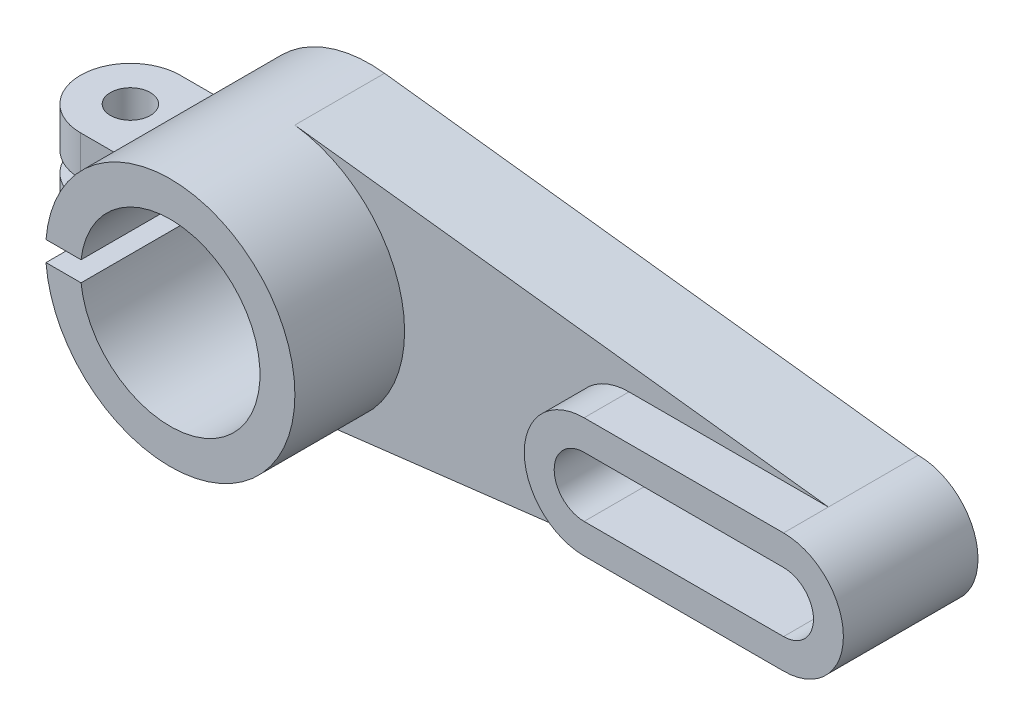
ISO-10303-21;
HEADER;
FILE_DESCRIPTION(('STEP AP214'),'2;1');
FILE_NAME('part.step','',(''),(''),'','','');
FILE_SCHEMA(('AUTOMOTIVE_DESIGN { 1 0 10303 214 1 1 1 1 }'));
ENDSEC;
DATA;
#1=APPLICATION_CONTEXT('core data for automotive mechanical design processes');
#2=APPLICATION_PROTOCOL_DEFINITION('international standard','automotive_design',2000,#1);
#3=PRODUCT_CONTEXT('',#1,'mechanical');
#4=PRODUCT('Part','Part','',(#3));
#5=PRODUCT_RELATED_PRODUCT_CATEGORY('part','',(#4));
#6=PRODUCT_DEFINITION_FORMATION('','',#4);
#7=PRODUCT_DEFINITION_CONTEXT('part definition',#1,'design');
#8=PRODUCT_DEFINITION('design','',#6,#7);
#9=PRODUCT_DEFINITION_SHAPE('','',#8);
#10=(LENGTH_UNIT() NAMED_UNIT(*) SI_UNIT(.MILLI.,.METRE.));
#11=(NAMED_UNIT(*) PLANE_ANGLE_UNIT() SI_UNIT($,.RADIAN.));
#12=(NAMED_UNIT(*) SI_UNIT($,.STERADIAN.) SOLID_ANGLE_UNIT());
#13=UNCERTAINTY_MEASURE_WITH_UNIT(LENGTH_MEASURE(1.E-05),#10,'distance_accuracy_value','');
#14=(GEOMETRIC_REPRESENTATION_CONTEXT(3) GLOBAL_UNCERTAINTY_ASSIGNED_CONTEXT((#13)) GLOBAL_UNIT_ASSIGNED_CONTEXT((#10,
#11,#12)) REPRESENTATION_CONTEXT('',''));
#15=CARTESIAN_POINT('',(0.,0.,0.));
#16=DIRECTION('',(0.,0.,1.));
#17=DIRECTION('',(1.,0.,0.));
#18=AXIS2_PLACEMENT_3D('',#15,#16,#17);
#19=CARTESIAN_POINT('',(0.,0.,-18.));
#20=DIRECTION('',(0.,0.,1.));
#21=DIRECTION('',(1.,0.,0.));
#22=AXIS2_PLACEMENT_3D('',#19,#20,#21);
#23=CYLINDRICAL_SURFACE('',#22,25.);
#24=CARTESIAN_POINT('',(0.,0.,-18.));
#25=DIRECTION('',(0.,0.,1.));
#26=DIRECTION('',(1.,0.,0.));
#27=AXIS2_PLACEMENT_3D('',#24,#25,#26);
#28=CIRCLE('',#27,25.);
#29=CARTESIAN_POINT('',(2.97391051929117,24.8224869064977,-18.));
#30=VERTEX_POINT('',#29);
#31=CARTESIAN_POINT('',(-24.9198715887542,2.,-18.));
#32=VERTEX_POINT('',#31);
#33=EDGE_CURVE('E306',#30,#32,#28,.T.);
#34=ORIENTED_EDGE('',*,*,#33,.T.);
#35=DIRECTION('',(0.,0.,1.));
#36=VECTOR('',#35,1.);
#37=CARTESIAN_POINT('',(-24.9198715887542,2.,-18.));
#38=LINE('',#37,#36);
#39=CARTESIAN_POINT('',(-24.9198715887542,2.,-12.));
#40=VERTEX_POINT('',#39);
#41=EDGE_CURVE('E492',#32,#40,#38,.T.);
#42=ORIENTED_EDGE('',*,*,#41,.T.);
#43=CARTESIAN_POINT('',(0.,0.,-12.));
#44=DIRECTION('',(0.,0.,1.));
#45=DIRECTION('',(1.,0.,0.));
#46=AXIS2_PLACEMENT_3D('',#43,#44,#45);
#47=CIRCLE('',#46,25.);
#48=CARTESIAN_POINT('',(-22.9128784747792,10.,-12.));
#49=VERTEX_POINT('',#48);
#50=EDGE_CURVE('E44',#40,#49,#47,.F.);
#51=ORIENTED_EDGE('',*,*,#50,.T.);
#52=DIRECTION('',(0.,0.,1.));
#53=VECTOR('',#52,1.);
#54=CARTESIAN_POINT('',(-22.9128784747792,10.,-18.));
#55=LINE('',#54,#53);
#56=CARTESIAN_POINT('',(-22.9128784747792,10.,8.));
#57=VERTEX_POINT('',#56);
#58=EDGE_CURVE('E224',#57,#49,#55,.F.);
#59=ORIENTED_EDGE('',*,*,#58,.F.);
#60=CARTESIAN_POINT('',(0.,0.,7.99999999999999));
#61=DIRECTION('',(0.,0.,-1.));
#62=DIRECTION('',(-1.,0.,0.));
#63=AXIS2_PLACEMENT_3D('',#60,#61,#62);
#64=CIRCLE('',#63,25.);
#65=CARTESIAN_POINT('',(-24.9198715887542,2.,8.));
#66=VERTEX_POINT('',#65);
#67=EDGE_CURVE('E213',#57,#66,#64,.F.);
#68=ORIENTED_EDGE('',*,*,#67,.T.);
#69=CARTESIAN_POINT('',(-24.9198715887542,2.,22.));
#70=VERTEX_POINT('',#69);
#71=EDGE_CURVE('E60',#66,#70,#38,.T.);
#72=ORIENTED_EDGE('',*,*,#71,.T.);
#73=CARTESIAN_POINT('',(0.,0.,22.));
#74=DIRECTION('',(0.,0.,1.));
#75=DIRECTION('',(1.,0.,0.));
#76=AXIS2_PLACEMENT_3D('',#73,#74,#75);
#77=CIRCLE('',#76,25.);
#78=CARTESIAN_POINT('',(-24.9198715887542,-2.,22.));
#79=VERTEX_POINT('',#78);
#80=EDGE_CURVE('E206',#79,#70,#77,.T.);
#81=ORIENTED_EDGE('',*,*,#80,.F.);
#82=DIRECTION('',(0.,0.,1.));
#83=VECTOR('',#82,1.);
#84=CARTESIAN_POINT('',(-24.9198715887542,-2.,-18.));
#85=LINE('',#84,#83);
#86=CARTESIAN_POINT('',(-24.9198715887542,-2.,8.));
#87=VERTEX_POINT('',#86);
#88=EDGE_CURVE('E192',#79,#87,#85,.F.);
#89=ORIENTED_EDGE('',*,*,#88,.T.);
#90=CARTESIAN_POINT('',(-22.9128784747792,-10.,8.));
#91=VERTEX_POINT('',#90);
#92=EDGE_CURVE('E203',#87,#91,#64,.F.);
#93=ORIENTED_EDGE('',*,*,#92,.T.);
#94=DIRECTION('',(0.,0.,1.));
#95=VECTOR('',#94,1.);
#96=CARTESIAN_POINT('',(-22.9128784747792,-10.,-18.));
#97=LINE('',#96,#95);
#98=CARTESIAN_POINT('',(-22.9128784747792,-10.,-12.));
#99=VERTEX_POINT('',#98);
#100=EDGE_CURVE('E217',#91,#99,#97,.F.);
#101=ORIENTED_EDGE('',*,*,#100,.T.);
#102=CARTESIAN_POINT('',(-24.9198715887542,-2.,-12.));
#103=VERTEX_POINT('',#102);
#104=EDGE_CURVE('E11',#99,#103,#47,.F.);
#105=ORIENTED_EDGE('',*,*,#104,.T.);
#106=CARTESIAN_POINT('',(-24.9198715887542,-2.,-18.));
#107=VERTEX_POINT('',#106);
#108=EDGE_CURVE('E208',#103,#107,#85,.F.);
#109=ORIENTED_EDGE('',*,*,#108,.T.);
#110=CARTESIAN_POINT('',(2.97391051929117,-24.8224869064977,-18.));
#111=VERTEX_POINT('',#110);
#112=EDGE_CURVE('E305',#107,#111,#28,.T.);
#113=ORIENTED_EDGE('',*,*,#112,.T.);
#114=DIRECTION('',(0.,0.,1.));
#115=VECTOR('',#114,1.);
#116=CARTESIAN_POINT('',(2.97391051929117,-24.8224869064977,-18.));
#117=LINE('',#116,#115);
#118=CARTESIAN_POINT('',(2.97391051929117,-24.8224869064977,0.));
#119=VERTEX_POINT('',#118);
#120=EDGE_CURVE('E314',#111,#119,#117,.T.);
#121=ORIENTED_EDGE('',*,*,#120,.T.);
#122=CARTESIAN_POINT('',(0.,0.,0.));
#123=DIRECTION('',(0.,0.,1.));
#124=DIRECTION('',(1.,0.,0.));
#125=AXIS2_PLACEMENT_3D('',#122,#123,#124);
#126=CIRCLE('',#125,25.);
#127=CARTESIAN_POINT('',(2.97391051929116,24.8224869064977,0.));
#128=VERTEX_POINT('',#127);
#129=EDGE_CURVE('E214',#119,#128,#126,.T.);
#130=ORIENTED_EDGE('',*,*,#129,.T.);
#131=DIRECTION('',(0.,0.,1.));
#132=VECTOR('',#131,1.);
#133=CARTESIAN_POINT('',(2.97391051929117,24.8224869064977,-18.));
#134=LINE('',#133,#132);
#135=EDGE_CURVE('E275',#30,#128,#134,.T.);
#136=ORIENTED_EDGE('',*,*,#135,.F.);
#137=EDGE_LOOP('',(#34,#42,#51,#59,#68,#72,#81,#89,#93,#101,#105,#109,#113,#121,#130,#136));
#138=FACE_BOUND('',#137,.T.);
#139=ADVANCED_FACE('F35',(#138),#23,.T.);
#140=CARTESIAN_POINT('',(110.,0.,-18.));
#141=DIRECTION('',(0.,0.,1.));
#142=DIRECTION('',(1.,0.,0.));
#143=AXIS2_PLACEMENT_3D('',#140,#141,#142);
#144=PLANE('',#143);
#145=CARTESIAN_POINT('',(70.,0.,-18.));
#146=DIRECTION('',(0.,0.,1.));
#147=DIRECTION('',(1.,0.,0.));
#148=AXIS2_PLACEMENT_3D('',#145,#146,#147);
#149=CIRCLE('',#148,6.);
#150=CARTESIAN_POINT('',(70.,6.,-18.));
#151=VERTEX_POINT('',#150);
#152=CARTESIAN_POINT('',(70.,-6.,-18.));
#153=VERTEX_POINT('',#152);
#154=EDGE_CURVE('E360',#151,#153,#149,.T.);
#155=ORIENTED_EDGE('',*,*,#154,.T.);
#156=DIRECTION('',(1.,0.,0.));
#157=VECTOR('',#156,1.);
#158=CARTESIAN_POINT('',(0.,-6.,-18.));
#159=LINE('',#158,#157);
#160=CARTESIAN_POINT('',(110.,-6.,-18.));
#161=VERTEX_POINT('',#160);
#162=EDGE_CURVE('E351',#153,#161,#159,.T.);
#163=ORIENTED_EDGE('',*,*,#162,.T.);
#164=CARTESIAN_POINT('',(110.,0.,-18.));
#165=DIRECTION('',(0.,0.,1.));
#166=DIRECTION('',(1.,0.,0.));
#167=AXIS2_PLACEMENT_3D('',#164,#165,#166);
#168=CIRCLE('',#167,6.);
#169=CARTESIAN_POINT('',(110.,6.,-18.));
#170=VERTEX_POINT('',#169);
#171=EDGE_CURVE('E354',#161,#170,#168,.T.);
#172=ORIENTED_EDGE('',*,*,#171,.T.);
#173=DIRECTION('',(1.,0.,0.));
#174=VECTOR('',#173,1.);
#175=CARTESIAN_POINT('',(0.,6.,-18.));
#176=LINE('',#175,#174);
#177=EDGE_CURVE('E357',#151,#170,#176,.T.);
#178=ORIENTED_EDGE('',*,*,#177,.F.);
#179=EDGE_LOOP('',(#155,#163,#172,#178));
#180=FACE_BOUND('',#179,.T.);
#181=DIRECTION('',(1.,0.,0.));
#182=VECTOR('',#181,1.);
#183=CARTESIAN_POINT('',(110.,2.,-18.));
#184=LINE('',#183,#182);
#185=CARTESIAN_POINT('',(-17.8885438199983,2.,-18.));
#186=VERTEX_POINT('',#185);
#187=EDGE_CURVE('E496',#32,#186,#184,.T.);
#188=ORIENTED_EDGE('',*,*,#187,.F.);
#189=ORIENTED_EDGE('',*,*,#33,.F.);
#190=DIRECTION('',(-0.992899476259908,0.118956420771646,0.));
#191=VECTOR('',#190,1.);
#192=CARTESIAN_POINT('',(110.,12.,-18.));
#193=LINE('',#192,#191);
#194=CARTESIAN_POINT('',(110.,12.,-18.));
#195=VERTEX_POINT('',#194);
#196=EDGE_CURVE('E303',#195,#30,#193,.T.);
#197=ORIENTED_EDGE('',*,*,#196,.F.);
#198=CARTESIAN_POINT('',(110.,0.,-18.));
#199=DIRECTION('',(0.,0.,1.));
#200=DIRECTION('',(1.,0.,0.));
#201=AXIS2_PLACEMENT_3D('',#198,#199,#200);
#202=CIRCLE('',#201,12.);
#203=CARTESIAN_POINT('',(110.,-12.,-18.));
#204=VERTEX_POINT('',#203);
#205=EDGE_CURVE('E300',#204,#195,#202,.T.);
#206=ORIENTED_EDGE('',*,*,#205,.F.);
#207=DIRECTION('',(0.992899476259908,0.118956420771646,0.));
#208=VECTOR('',#207,1.);
#209=CARTESIAN_POINT('',(110.,-12.,-18.));
#210=LINE('',#209,#208);
#211=EDGE_CURVE('E308',#111,#204,#210,.T.);
#212=ORIENTED_EDGE('',*,*,#211,.F.);
#213=ORIENTED_EDGE('',*,*,#112,.F.);
#214=DIRECTION('',(-1.,0.,0.));
#215=VECTOR('',#214,1.);
#216=CARTESIAN_POINT('',(110.,-2.,-18.));
#217=LINE('',#216,#215);
#218=CARTESIAN_POINT('',(-17.8885438199983,-2.,-18.));
#219=VERTEX_POINT('',#218);
#220=EDGE_CURVE('E329',#219,#107,#217,.T.);
#221=ORIENTED_EDGE('',*,*,#220,.F.);
#222=CARTESIAN_POINT('',(0.,0.,-18.));
#223=DIRECTION('',(0.,0.,1.));
#224=DIRECTION('',(1.,0.,0.));
#225=AXIS2_PLACEMENT_3D('',#222,#223,#224);
#226=CIRCLE('',#225,18.);
#227=EDGE_CURVE('E331',#219,#186,#226,.T.);
#228=ORIENTED_EDGE('',*,*,#227,.T.);
#229=EDGE_LOOP('',(#188,#189,#197,#206,#212,#213,#221,#228));
#230=FACE_BOUND('',#229,.T.);
#231=ADVANCED_FACE('F245',(#180,#230),#144,.F.);
#232=CARTESIAN_POINT('',(0.,0.,22.));
#233=DIRECTION('',(0.,0.,1.));
#234=DIRECTION('',(1.,0.,0.));
#235=AXIS2_PLACEMENT_3D('',#232,#233,#234);
#236=PLANE('',#235);
#237=ORIENTED_EDGE('',*,*,#80,.T.);
#238=DIRECTION('',(1.,0.,0.));
#239=VECTOR('',#238,1.);
#240=CARTESIAN_POINT('',(0.,2.,22.));
#241=LINE('',#240,#239);
#242=CARTESIAN_POINT('',(-17.8885438199983,2.,22.));
#243=VERTEX_POINT('',#242);
#244=EDGE_CURVE('E493',#70,#243,#241,.T.);
#245=ORIENTED_EDGE('',*,*,#244,.T.);
#246=CARTESIAN_POINT('',(0.,0.,22.));
#247=DIRECTION('',(0.,0.,1.));
#248=DIRECTION('',(1.,0.,0.));
#249=AXIS2_PLACEMENT_3D('',#246,#247,#248);
#250=CIRCLE('',#249,18.);
#251=CARTESIAN_POINT('',(-17.8885438199983,-2.,22.));
#252=VERTEX_POINT('',#251);
#253=EDGE_CURVE('E341',#252,#243,#250,.T.);
#254=ORIENTED_EDGE('',*,*,#253,.F.);
#255=DIRECTION('',(-1.,0.,0.));
#256=VECTOR('',#255,1.);
#257=CARTESIAN_POINT('',(0.,-2.,22.));
#258=LINE('',#257,#256);
#259=EDGE_CURVE('E529',#252,#79,#258,.T.);
#260=ORIENTED_EDGE('',*,*,#259,.T.);
#261=EDGE_LOOP('',(#237,#245,#254,#260));
#262=FACE_BOUND('',#261,.T.);
#263=ADVANCED_FACE('F250',(#262),#236,.T.);
#264=CARTESIAN_POINT('',(0.,0.,-70.7106781186548));
#265=DIRECTION('',(0.,0.,1.));
#266=DIRECTION('',(1.,0.,0.));
#267=AXIS2_PLACEMENT_3D('',#264,#265,#266);
#268=CYLINDRICAL_SURFACE('',#267,18.);
#269=DIRECTION('',(0.,0.,1.));
#270=VECTOR('',#269,1.);
#271=CARTESIAN_POINT('',(-17.8885438199983,2.,-70.7106781186548));
#272=LINE('',#271,#270);
#273=EDGE_CURVE('E340',#186,#243,#272,.T.);
#274=ORIENTED_EDGE('',*,*,#273,.F.);
#275=ORIENTED_EDGE('',*,*,#227,.F.);
#276=DIRECTION('',(0.,0.,1.));
#277=VECTOR('',#276,1.);
#278=CARTESIAN_POINT('',(-17.8885438199983,-2.,-70.7106781186548));
#279=LINE('',#278,#277);
#280=EDGE_CURVE('E332',#252,#219,#279,.F.);
#281=ORIENTED_EDGE('',*,*,#280,.F.);
#282=ORIENTED_EDGE('',*,*,#253,.T.);
#283=EDGE_LOOP('',(#274,#275,#281,#282));
#284=FACE_BOUND('',#283,.T.);
#285=ADVANCED_FACE('F337',(#284),#268,.F.);
#286=CARTESIAN_POINT('',(-19.,10.,-12.));
#287=DIRECTION('',(0.,0.,1.));
#288=DIRECTION('',(1.,0.,0.));
#289=AXIS2_PLACEMENT_3D('',#286,#287,#288);
#290=PLANE('',#289);
#291=DIRECTION('',(1.,0.,0.));
#292=VECTOR('',#291,1.);
#293=CARTESIAN_POINT('',(-19.,2.,-12.));
#294=LINE('',#293,#292);
#295=CARTESIAN_POINT('',(-32.,2.,-12.));
#296=VERTEX_POINT('',#295);
#297=EDGE_CURVE('E486',#296,#40,#294,.T.);
#298=ORIENTED_EDGE('',*,*,#297,.F.);
#299=DIRECTION('',(0.,-1.,0.));
#300=VECTOR('',#299,1.);
#301=CARTESIAN_POINT('',(-32.,10.,-12.));
#302=LINE('',#301,#300);
#303=CARTESIAN_POINT('',(-32.,10.,-12.));
#304=VERTEX_POINT('',#303);
#305=EDGE_CURVE('E342',#304,#296,#302,.T.);
#306=ORIENTED_EDGE('',*,*,#305,.F.);
#307=DIRECTION('',(-1.,0.,0.));
#308=VECTOR('',#307,1.);
#309=CARTESIAN_POINT('',(-19.,10.,-12.));
#310=LINE('',#309,#308);
#311=EDGE_CURVE('E504',#49,#304,#310,.T.);
#312=ORIENTED_EDGE('',*,*,#311,.F.);
#313=ORIENTED_EDGE('',*,*,#50,.F.);
#314=EDGE_LOOP('',(#298,#306,#312,#313));
#315=FACE_BOUND('',#314,.T.);
#316=ADVANCED_FACE('F451',(#315),#290,.F.);
#317=DIRECTION('',(-1.,0.,0.));
#318=VECTOR('',#317,1.);
#319=CARTESIAN_POINT('',(-19.,-2.,-12.));
#320=LINE('',#319,#318);
#321=CARTESIAN_POINT('',(-32.,-2.,-12.));
#322=VERTEX_POINT('',#321);
#323=EDGE_CURVE('E528',#103,#322,#320,.T.);
#324=ORIENTED_EDGE('',*,*,#323,.F.);
#325=ORIENTED_EDGE('',*,*,#104,.F.);
#326=DIRECTION('',(-1.,0.,0.));
#327=VECTOR('',#326,1.);
#328=CARTESIAN_POINT('',(-19.,-10.,-12.));
#329=LINE('',#328,#327);
#330=CARTESIAN_POINT('',(-32.,-10.,-12.));
#331=VERTEX_POINT('',#330);
#332=EDGE_CURVE('E501',#99,#331,#329,.T.);
#333=ORIENTED_EDGE('',*,*,#332,.T.);
#334=EDGE_CURVE('E346',#322,#331,#302,.T.);
#335=ORIENTED_EDGE('',*,*,#334,.F.);
#336=EDGE_LOOP('',(#324,#325,#333,#335));
#337=FACE_BOUND('',#336,.T.);
#338=ADVANCED_FACE('F454',(#337),#290,.F.);
#339=CARTESIAN_POINT('',(-32.,10.,-2.));
#340=DIRECTION('',(0.,-1.,0.));
#341=DIRECTION('',(0.,0.,-1.));
#342=AXIS2_PLACEMENT_3D('',#339,#340,#341);
#343=CYLINDRICAL_SURFACE('',#342,10.);
#344=ORIENTED_EDGE('',*,*,#305,.T.);
#345=CARTESIAN_POINT('',(-32.,2.,-2.));
#346=DIRECTION('',(0.,-1.,0.));
#347=DIRECTION('',(0.,0.,-1.));
#348=AXIS2_PLACEMENT_3D('',#345,#346,#347);
#349=CIRCLE('',#348,10.);
#350=CARTESIAN_POINT('',(-32.,2.,8.));
#351=VERTEX_POINT('',#350);
#352=EDGE_CURVE('E483',#351,#296,#349,.T.);
#353=ORIENTED_EDGE('',*,*,#352,.F.);
#354=DIRECTION('',(0.,-1.,0.));
#355=VECTOR('',#354,1.);
#356=CARTESIAN_POINT('',(-32.,10.,8.));
#357=LINE('',#356,#355);
#358=CARTESIAN_POINT('',(-32.,10.,8.));
#359=VERTEX_POINT('',#358);
#360=EDGE_CURVE('E517',#359,#351,#357,.T.);
#361=ORIENTED_EDGE('',*,*,#360,.F.);
#362=CARTESIAN_POINT('',(-32.,10.,-2.));
#363=DIRECTION('',(0.,1.,0.));
#364=DIRECTION('',(0.,0.,1.));
#365=AXIS2_PLACEMENT_3D('',#362,#363,#364);
#366=CIRCLE('',#365,10.);
#367=EDGE_CURVE('E506',#304,#359,#366,.T.);
#368=ORIENTED_EDGE('',*,*,#367,.F.);
#369=EDGE_LOOP('',(#344,#353,#361,#368));
#370=FACE_BOUND('',#369,.T.);
#371=ADVANCED_FACE('F456',(#370),#343,.T.);
#372=CARTESIAN_POINT('',(-32.,-2.,8.));
#373=VERTEX_POINT('',#372);
#374=CARTESIAN_POINT('',(-32.,-10.,8.));
#375=VERTEX_POINT('',#374);
#376=EDGE_CURVE('E511',#373,#375,#357,.T.);
#377=ORIENTED_EDGE('',*,*,#376,.F.);
#378=CARTESIAN_POINT('',(-32.,-2.,-2.));
#379=DIRECTION('',(0.,1.,0.));
#380=DIRECTION('',(0.,0.,1.));
#381=AXIS2_PLACEMENT_3D('',#378,#379,#380);
#382=CIRCLE('',#381,10.);
#383=EDGE_CURVE('E52',#322,#373,#382,.T.);
#384=ORIENTED_EDGE('',*,*,#383,.F.);
#385=ORIENTED_EDGE('',*,*,#334,.T.);
#386=CARTESIAN_POINT('',(-32.,-10.,-2.));
#387=DIRECTION('',(0.,1.,0.));
#388=DIRECTION('',(0.,0.,1.));
#389=AXIS2_PLACEMENT_3D('',#386,#387,#388);
#390=CIRCLE('',#389,10.);
#391=EDGE_CURVE('E514',#331,#375,#390,.T.);
#392=ORIENTED_EDGE('',*,*,#391,.T.);
#393=EDGE_LOOP('',(#377,#384,#385,#392));
#394=FACE_BOUND('',#393,.T.);
#395=ADVANCED_FACE('F459',(#394),#343,.T.);
#396=CARTESIAN_POINT('',(-19.,10.,8.));
#397=DIRECTION('',(0.,0.,-1.));
#398=DIRECTION('',(-1.,0.,0.));
#399=AXIS2_PLACEMENT_3D('',#396,#397,#398);
#400=PLANE('',#399);
#401=DIRECTION('',(-1.,0.,0.));
#402=VECTOR('',#401,1.);
#403=CARTESIAN_POINT('',(-19.,2.,8.));
#404=LINE('',#403,#402);
#405=EDGE_CURVE('E482',#66,#351,#404,.T.);
#406=ORIENTED_EDGE('',*,*,#405,.F.);
#407=ORIENTED_EDGE('',*,*,#67,.F.);
#408=DIRECTION('',(1.,0.,0.));
#409=VECTOR('',#408,1.);
#410=CARTESIAN_POINT('',(-19.,10.,8.));
#411=LINE('',#410,#409);
#412=EDGE_CURVE('E508',#359,#57,#411,.T.);
#413=ORIENTED_EDGE('',*,*,#412,.F.);
#414=ORIENTED_EDGE('',*,*,#360,.T.);
#415=EDGE_LOOP('',(#406,#407,#413,#414));
#416=FACE_BOUND('',#415,.T.);
#417=ADVANCED_FACE('F461',(#416),#400,.F.);
#418=DIRECTION('',(1.,0.,0.));
#419=VECTOR('',#418,1.);
#420=CARTESIAN_POINT('',(-19.,-2.,8.));
#421=LINE('',#420,#419);
#422=EDGE_CURVE('E189',#373,#87,#421,.T.);
#423=ORIENTED_EDGE('',*,*,#422,.F.);
#424=ORIENTED_EDGE('',*,*,#376,.T.);
#425=DIRECTION('',(1.,0.,0.));
#426=VECTOR('',#425,1.);
#427=CARTESIAN_POINT('',(-19.,-10.,8.));
#428=LINE('',#427,#426);
#429=EDGE_CURVE('E211',#375,#91,#428,.T.);
#430=ORIENTED_EDGE('',*,*,#429,.T.);
#431=ORIENTED_EDGE('',*,*,#92,.F.);
#432=EDGE_LOOP('',(#423,#424,#430,#431));
#433=FACE_BOUND('',#432,.T.);
#434=ADVANCED_FACE('F209',(#433),#400,.F.);
#435=CARTESIAN_POINT('',(-32.,10.,-2.));
#436=DIRECTION('',(0.,-1.,0.));
#437=DIRECTION('',(0.,0.,-1.));
#438=AXIS2_PLACEMENT_3D('',#435,#436,#437);
#439=CYLINDRICAL_SURFACE('',#438,3.99999999999999);
#440=CARTESIAN_POINT('',(-32.,10.,-2.));
#441=DIRECTION('',(0.,1.,0.));
#442=DIRECTION('',(0.,0.,1.));
#443=AXIS2_PLACEMENT_3D('',#440,#441,#442);
#444=CIRCLE('',#443,3.99999999999999);
#445=CARTESIAN_POINT('',(-32.,10.,1.99999999999999));
#446=VERTEX_POINT('',#445);
#447=EDGE_CURVE('E479',#446,#446,#444,.T.);
#448=ORIENTED_EDGE('',*,*,#447,.T.);
#449=EDGE_LOOP('',(#448));
#450=FACE_BOUND('',#449,.T.);
#451=CARTESIAN_POINT('',(-32.,2.,-2.));
#452=DIRECTION('',(0.,-1.,0.));
#453=DIRECTION('',(0.,0.,-1.));
#454=AXIS2_PLACEMENT_3D('',#451,#452,#453);
#455=CIRCLE('',#454,3.99999999999999);
#456=CARTESIAN_POINT('',(-32.,2.,-5.99999999999999));
#457=VERTEX_POINT('',#456);
#458=EDGE_CURVE('E39',#457,#457,#455,.T.);
#459=ORIENTED_EDGE('',*,*,#458,.T.);
#460=EDGE_LOOP('',(#459));
#461=FACE_BOUND('',#460,.T.);
#462=ADVANCED_FACE('F468',(#450,#461),#439,.F.);
#463=CARTESIAN_POINT('',(-32.,-10.,-2.));
#464=DIRECTION('',(0.,1.,0.));
#465=DIRECTION('',(0.,0.,1.));
#466=AXIS2_PLACEMENT_3D('',#463,#464,#465);
#467=CIRCLE('',#466,3.99999999999999);
#468=CARTESIAN_POINT('',(-32.,-10.,1.99999999999999));
#469=VERTEX_POINT('',#468);
#470=EDGE_CURVE('E499',#469,#469,#467,.T.);
#471=ORIENTED_EDGE('',*,*,#470,.F.);
#472=EDGE_LOOP('',(#471));
#473=FACE_BOUND('',#472,.T.);
#474=CARTESIAN_POINT('',(-32.,-2.,-2.));
#475=DIRECTION('',(0.,1.,0.));
#476=DIRECTION('',(0.,0.,1.));
#477=AXIS2_PLACEMENT_3D('',#474,#475,#476);
#478=CIRCLE('',#477,3.99999999999999);
#479=CARTESIAN_POINT('',(-32.,-2.,1.99999999999999));
#480=VERTEX_POINT('',#479);
#481=EDGE_CURVE('E197',#480,#480,#478,.T.);
#482=ORIENTED_EDGE('',*,*,#481,.T.);
#483=EDGE_LOOP('',(#482));
#484=FACE_BOUND('',#483,.T.);
#485=ADVANCED_FACE('F229',(#473,#484),#439,.F.);
#486=CARTESIAN_POINT('',(110.,0.,-18.));
#487=DIRECTION('',(0.,0.,1.));
#488=DIRECTION('',(1.,0.,0.));
#489=AXIS2_PLACEMENT_3D('',#486,#487,#488);
#490=CYLINDRICAL_SURFACE('',#489,12.);
#491=DIRECTION('',(0.,0.,1.));
#492=VECTOR('',#491,1.);
#493=CARTESIAN_POINT('',(110.,12.,-18.));
#494=LINE('',#493,#492);
#495=CARTESIAN_POINT('',(110.,12.,0.));
#496=VERTEX_POINT('',#495);
#497=EDGE_CURVE('E273',#195,#496,#494,.T.);
#498=ORIENTED_EDGE('',*,*,#497,.T.);
#499=DIRECTION('',(0.,0.,1.));
#500=VECTOR('',#499,1.);
#501=CARTESIAN_POINT('',(110.,12.,0.));
#502=LINE('',#501,#500);
#503=CARTESIAN_POINT('',(110.,12.,9.));
#504=VERTEX_POINT('',#503);
#505=EDGE_CURVE('E282',#496,#504,#502,.T.);
#506=ORIENTED_EDGE('',*,*,#505,.T.);
#507=CARTESIAN_POINT('',(110.,0.,9.));
#508=DIRECTION('',(0.,0.,1.));
#509=DIRECTION('',(1.,0.,0.));
#510=AXIS2_PLACEMENT_3D('',#507,#508,#509);
#511=CIRCLE('',#510,12.);
#512=CARTESIAN_POINT('',(110.,-12.,9.));
#513=VERTEX_POINT('',#512);
#514=EDGE_CURVE('E377',#513,#504,#511,.T.);
#515=ORIENTED_EDGE('',*,*,#514,.F.);
#516=DIRECTION('',(0.,0.,1.));
#517=VECTOR('',#516,1.);
#518=CARTESIAN_POINT('',(110.,-12.,0.));
#519=LINE('',#518,#517);
#520=CARTESIAN_POINT('',(110.,-12.,0.));
#521=VERTEX_POINT('',#520);
#522=EDGE_CURVE('E277',#521,#513,#519,.T.);
#523=ORIENTED_EDGE('',*,*,#522,.F.);
#524=DIRECTION('',(0.,0.,1.));
#525=VECTOR('',#524,1.);
#526=CARTESIAN_POINT('',(110.,-12.,-18.));
#527=LINE('',#526,#525);
#528=EDGE_CURVE('E219',#204,#521,#527,.T.);
#529=ORIENTED_EDGE('',*,*,#528,.F.);
#530=ORIENTED_EDGE('',*,*,#205,.T.);
#531=EDGE_LOOP('',(#498,#506,#515,#523,#529,#530));
#532=FACE_BOUND('',#531,.T.);
#533=ADVANCED_FACE('F37',(#532),#490,.T.);
#534=CARTESIAN_POINT('',(110.,-12.,-18.));
#535=DIRECTION('',(0.118956420771646,-0.992899476259908,0.));
#536=DIRECTION('',(0.992899476259908,0.118956420771646,0.));
#537=AXIS2_PLACEMENT_3D('',#534,#535,#536);
#538=PLANE('',#537);
#539=DIRECTION('',(0.992899476259908,0.118956420771646,0.));
#540=VECTOR('',#539,1.);
#541=CARTESIAN_POINT('',(110.,-12.,0.));
#542=LINE('',#541,#540);
#543=EDGE_CURVE('E276',#119,#521,#542,.T.);
#544=ORIENTED_EDGE('',*,*,#543,.F.);
#545=ORIENTED_EDGE('',*,*,#120,.F.);
#546=ORIENTED_EDGE('',*,*,#211,.T.);
#547=ORIENTED_EDGE('',*,*,#528,.T.);
#548=EDGE_LOOP('',(#544,#545,#546,#547));
#549=FACE_BOUND('',#548,.T.);
#550=ADVANCED_FACE('F254',(#549),#538,.T.);
#551=CARTESIAN_POINT('',(110.,12.,-18.));
#552=DIRECTION('',(0.118956420771646,0.992899476259908,0.));
#553=DIRECTION('',(-0.992899476259908,0.118956420771646,0.));
#554=AXIS2_PLACEMENT_3D('',#551,#552,#553);
#555=PLANE('',#554);
#556=DIRECTION('',(-0.992899476259908,0.118956420771646,0.));
#557=VECTOR('',#556,1.);
#558=CARTESIAN_POINT('',(110.,12.,0.));
#559=LINE('',#558,#557);
#560=EDGE_CURVE('E269',#496,#128,#559,.T.);
#561=ORIENTED_EDGE('',*,*,#560,.F.);
#562=ORIENTED_EDGE('',*,*,#497,.F.);
#563=ORIENTED_EDGE('',*,*,#196,.T.);
#564=ORIENTED_EDGE('',*,*,#135,.T.);
#565=EDGE_LOOP('',(#561,#562,#563,#564));
#566=FACE_BOUND('',#565,.T.);
#567=ADVANCED_FACE('F256',(#566),#555,.T.);
#568=CARTESIAN_POINT('',(110.,0.,0.));
#569=DIRECTION('',(0.,0.,1.));
#570=DIRECTION('',(1.,0.,0.));
#571=AXIS2_PLACEMENT_3D('',#568,#569,#570);
#572=PLANE('',#571);
#573=ORIENTED_EDGE('',*,*,#129,.F.);
#574=ORIENTED_EDGE('',*,*,#543,.T.);
#575=DIRECTION('',(1.,0.,0.));
#576=VECTOR('',#575,1.);
#577=CARTESIAN_POINT('',(110.,-12.,0.));
#578=LINE('',#577,#576);
#579=CARTESIAN_POINT('',(70.,-12.,0.));
#580=VERTEX_POINT('',#579);
#581=EDGE_CURVE('E291',#580,#521,#578,.T.);
#582=ORIENTED_EDGE('',*,*,#581,.F.);
#583=CARTESIAN_POINT('',(70.,0.,0.));
#584=DIRECTION('',(0.,0.,1.));
#585=DIRECTION('',(1.,0.,0.));
#586=AXIS2_PLACEMENT_3D('',#583,#584,#585);
#587=CIRCLE('',#586,12.);
#588=CARTESIAN_POINT('',(70.,12.,0.));
#589=VERTEX_POINT('',#588);
#590=EDGE_CURVE('E296',#589,#580,#587,.T.);
#591=ORIENTED_EDGE('',*,*,#590,.F.);
#592=DIRECTION('',(-1.,0.,0.));
#593=VECTOR('',#592,1.);
#594=CARTESIAN_POINT('',(110.,12.,0.));
#595=LINE('',#594,#593);
#596=EDGE_CURVE('E284',#496,#589,#595,.T.);
#597=ORIENTED_EDGE('',*,*,#596,.F.);
#598=ORIENTED_EDGE('',*,*,#560,.T.);
#599=EDGE_LOOP('',(#573,#574,#582,#591,#597,#598));
#600=FACE_BOUND('',#599,.T.);
#601=ADVANCED_FACE('F258',(#600),#572,.T.);
#602=CARTESIAN_POINT('',(110.,-12.,0.));
#603=DIRECTION('',(0.,-1.,0.));
#604=DIRECTION('',(1.,0.,0.));
#605=AXIS2_PLACEMENT_3D('',#602,#603,#604);
#606=PLANE('',#605);
#607=DIRECTION('',(1.,0.,0.));
#608=VECTOR('',#607,1.);
#609=CARTESIAN_POINT('',(110.,-12.,9.));
#610=LINE('',#609,#608);
#611=CARTESIAN_POINT('',(70.,-12.,9.));
#612=VERTEX_POINT('',#611);
#613=EDGE_CURVE('E385',#612,#513,#610,.T.);
#614=ORIENTED_EDGE('',*,*,#613,.F.);
#615=DIRECTION('',(0.,0.,1.));
#616=VECTOR('',#615,1.);
#617=CARTESIAN_POINT('',(70.,-12.,0.));
#618=LINE('',#617,#616);
#619=EDGE_CURVE('E293',#580,#612,#618,.T.);
#620=ORIENTED_EDGE('',*,*,#619,.F.);
#621=ORIENTED_EDGE('',*,*,#581,.T.);
#622=ORIENTED_EDGE('',*,*,#522,.T.);
#623=EDGE_LOOP('',(#614,#620,#621,#622));
#624=FACE_BOUND('',#623,.T.);
#625=ADVANCED_FACE('F264',(#624),#606,.T.);
#626=CARTESIAN_POINT('',(70.,0.,0.));
#627=DIRECTION('',(0.,0.,1.));
#628=DIRECTION('',(1.,0.,0.));
#629=AXIS2_PLACEMENT_3D('',#626,#627,#628);
#630=CYLINDRICAL_SURFACE('',#629,12.);
#631=CARTESIAN_POINT('',(70.,0.,9.));
#632=DIRECTION('',(0.,0.,1.));
#633=DIRECTION('',(1.,0.,0.));
#634=AXIS2_PLACEMENT_3D('',#631,#632,#633);
#635=CIRCLE('',#634,12.);
#636=CARTESIAN_POINT('',(70.,12.,9.));
#637=VERTEX_POINT('',#636);
#638=EDGE_CURVE('E390',#637,#612,#635,.T.);
#639=ORIENTED_EDGE('',*,*,#638,.F.);
#640=DIRECTION('',(0.,0.,1.));
#641=VECTOR('',#640,1.);
#642=CARTESIAN_POINT('',(70.,12.,0.));
#643=LINE('',#642,#641);
#644=EDGE_CURVE('E290',#589,#637,#643,.T.);
#645=ORIENTED_EDGE('',*,*,#644,.F.);
#646=ORIENTED_EDGE('',*,*,#590,.T.);
#647=ORIENTED_EDGE('',*,*,#619,.T.);
#648=EDGE_LOOP('',(#639,#645,#646,#647));
#649=FACE_BOUND('',#648,.T.);
#650=ADVANCED_FACE('F398',(#649),#630,.T.);
#651=CARTESIAN_POINT('',(110.,12.,0.));
#652=DIRECTION('',(0.,1.,0.));
#653=DIRECTION('',(-1.,0.,0.));
#654=AXIS2_PLACEMENT_3D('',#651,#652,#653);
#655=PLANE('',#654);
#656=DIRECTION('',(-1.,0.,0.));
#657=VECTOR('',#656,1.);
#658=CARTESIAN_POINT('',(110.,12.,9.));
#659=LINE('',#658,#657);
#660=EDGE_CURVE('E286',#504,#637,#659,.T.);
#661=ORIENTED_EDGE('',*,*,#660,.F.);
#662=ORIENTED_EDGE('',*,*,#505,.F.);
#663=ORIENTED_EDGE('',*,*,#596,.T.);
#664=ORIENTED_EDGE('',*,*,#644,.T.);
#665=EDGE_LOOP('',(#661,#662,#663,#664));
#666=FACE_BOUND('',#665,.T.);
#667=ADVANCED_FACE('F283',(#666),#655,.T.);
#668=CARTESIAN_POINT('',(110.,0.,9.));
#669=DIRECTION('',(0.,0.,1.));
#670=DIRECTION('',(1.,0.,0.));
#671=AXIS2_PLACEMENT_3D('',#668,#669,#670);
#672=PLANE('',#671);
#673=CARTESIAN_POINT('',(70.,0.,9.));
#674=DIRECTION('',(0.,0.,1.));
#675=DIRECTION('',(1.,0.,0.));
#676=AXIS2_PLACEMENT_3D('',#673,#674,#675);
#677=CIRCLE('',#676,6.);
#678=CARTESIAN_POINT('',(70.,6.,9.));
#679=VERTEX_POINT('',#678);
#680=CARTESIAN_POINT('',(70.,-6.,9.));
#681=VERTEX_POINT('',#680);
#682=EDGE_CURVE('E363',#679,#681,#677,.T.);
#683=ORIENTED_EDGE('',*,*,#682,.F.);
#684=DIRECTION('',(-1.,0.,0.));
#685=VECTOR('',#684,1.);
#686=CARTESIAN_POINT('',(70.,6.,9.));
#687=LINE('',#686,#685);
#688=CARTESIAN_POINT('',(110.,6.,9.));
#689=VERTEX_POINT('',#688);
#690=EDGE_CURVE('E371',#689,#679,#687,.T.);
#691=ORIENTED_EDGE('',*,*,#690,.F.);
#692=CARTESIAN_POINT('',(110.,0.,9.));
#693=DIRECTION('',(0.,0.,1.));
#694=DIRECTION('',(1.,0.,0.));
#695=AXIS2_PLACEMENT_3D('',#692,#693,#694);
#696=CIRCLE('',#695,6.);
#697=CARTESIAN_POINT('',(110.,-6.,9.));
#698=VERTEX_POINT('',#697);
#699=EDGE_CURVE('E368',#698,#689,#696,.T.);
#700=ORIENTED_EDGE('',*,*,#699,.F.);
#701=DIRECTION('',(1.,0.,0.));
#702=VECTOR('',#701,1.);
#703=CARTESIAN_POINT('',(70.,-6.,9.));
#704=LINE('',#703,#702);
#705=EDGE_CURVE('E365',#681,#698,#704,.T.);
#706=ORIENTED_EDGE('',*,*,#705,.F.);
#707=EDGE_LOOP('',(#683,#691,#700,#706));
#708=FACE_BOUND('',#707,.T.);
#709=ORIENTED_EDGE('',*,*,#514,.T.);
#710=ORIENTED_EDGE('',*,*,#660,.T.);
#711=ORIENTED_EDGE('',*,*,#638,.T.);
#712=ORIENTED_EDGE('',*,*,#613,.T.);
#713=EDGE_LOOP('',(#709,#710,#711,#712));
#714=FACE_BOUND('',#713,.T.);
#715=ADVANCED_FACE('F403',(#708,#714),#672,.T.);
#716=CARTESIAN_POINT('',(70.,0.,0.));
#717=DIRECTION('',(0.,0.,1.));
#718=DIRECTION('',(1.,0.,0.));
#719=AXIS2_PLACEMENT_3D('',#716,#717,#718);
#720=CYLINDRICAL_SURFACE('',#719,6.);
#721=ORIENTED_EDGE('',*,*,#682,.T.);
#722=DIRECTION('',(0.,0.,1.));
#723=VECTOR('',#722,1.);
#724=CARTESIAN_POINT('',(70.,-6.,0.));
#725=LINE('',#724,#723);
#726=EDGE_CURVE('E374',#153,#681,#725,.T.);
#727=ORIENTED_EDGE('',*,*,#726,.F.);
#728=ORIENTED_EDGE('',*,*,#154,.F.);
#729=DIRECTION('',(0.,0.,1.));
#730=VECTOR('',#729,1.);
#731=CARTESIAN_POINT('',(70.,6.,0.));
#732=LINE('',#731,#730);
#733=EDGE_CURVE('E375',#151,#679,#732,.T.);
#734=ORIENTED_EDGE('',*,*,#733,.T.);
#735=EDGE_LOOP('',(#721,#727,#728,#734));
#736=FACE_BOUND('',#735,.T.);
#737=ADVANCED_FACE('F417',(#736),#720,.F.);
#738=CARTESIAN_POINT('',(70.,6.,0.));
#739=DIRECTION('',(0.,1.,0.));
#740=DIRECTION('',(0.,0.,1.));
#741=AXIS2_PLACEMENT_3D('',#738,#739,#740);
#742=PLANE('',#741);
#743=ORIENTED_EDGE('',*,*,#690,.T.);
#744=ORIENTED_EDGE('',*,*,#733,.F.);
#745=ORIENTED_EDGE('',*,*,#177,.T.);
#746=DIRECTION('',(0.,0.,1.));
#747=VECTOR('',#746,1.);
#748=CARTESIAN_POINT('',(110.,6.,0.));
#749=LINE('',#748,#747);
#750=EDGE_CURVE('E378',#170,#689,#749,.T.);
#751=ORIENTED_EDGE('',*,*,#750,.T.);
#752=EDGE_LOOP('',(#743,#744,#745,#751));
#753=FACE_BOUND('',#752,.T.);
#754=ADVANCED_FACE('F422',(#753),#742,.F.);
#755=CARTESIAN_POINT('',(110.,0.,0.));
#756=DIRECTION('',(0.,0.,1.));
#757=DIRECTION('',(1.,0.,0.));
#758=AXIS2_PLACEMENT_3D('',#755,#756,#757);
#759=CYLINDRICAL_SURFACE('',#758,6.);
#760=ORIENTED_EDGE('',*,*,#699,.T.);
#761=ORIENTED_EDGE('',*,*,#750,.F.);
#762=ORIENTED_EDGE('',*,*,#171,.F.);
#763=DIRECTION('',(0.,0.,1.));
#764=VECTOR('',#763,1.);
#765=CARTESIAN_POINT('',(110.,-6.,0.));
#766=LINE('',#765,#764);
#767=EDGE_CURVE('E380',#161,#698,#766,.T.);
#768=ORIENTED_EDGE('',*,*,#767,.T.);
#769=EDGE_LOOP('',(#760,#761,#762,#768));
#770=FACE_BOUND('',#769,.T.);
#771=ADVANCED_FACE('F436',(#770),#759,.F.);
#772=CARTESIAN_POINT('',(70.,-6.,0.));
#773=DIRECTION('',(0.,-1.,0.));
#774=DIRECTION('',(0.,0.,-1.));
#775=AXIS2_PLACEMENT_3D('',#772,#773,#774);
#776=PLANE('',#775);
#777=ORIENTED_EDGE('',*,*,#705,.T.);
#778=ORIENTED_EDGE('',*,*,#767,.F.);
#779=ORIENTED_EDGE('',*,*,#162,.F.);
#780=ORIENTED_EDGE('',*,*,#726,.T.);
#781=EDGE_LOOP('',(#777,#778,#779,#780));
#782=FACE_BOUND('',#781,.T.);
#783=ADVANCED_FACE('F431',(#782),#776,.F.);
#784=CARTESIAN_POINT('',(-32.,10.,-2.));
#785=DIRECTION('',(0.,1.,0.));
#786=DIRECTION('',(0.,0.,1.));
#787=AXIS2_PLACEMENT_3D('',#784,#785,#786);
#788=PLANE('',#787);
#789=ORIENTED_EDGE('',*,*,#412,.T.);
#790=ORIENTED_EDGE('',*,*,#58,.T.);
#791=ORIENTED_EDGE('',*,*,#311,.T.);
#792=ORIENTED_EDGE('',*,*,#367,.T.);
#793=EDGE_LOOP('',(#789,#790,#791,#792));
#794=FACE_BOUND('',#793,.T.);
#795=ORIENTED_EDGE('',*,*,#447,.F.);
#796=EDGE_LOOP('',(#795));
#797=FACE_BOUND('',#796,.T.);
#798=ADVANCED_FACE('F241',(#794,#797),#788,.T.);
#799=CARTESIAN_POINT('',(-32.,-10.,-2.));
#800=DIRECTION('',(0.,1.,0.));
#801=DIRECTION('',(0.,0.,1.));
#802=AXIS2_PLACEMENT_3D('',#799,#800,#801);
#803=PLANE('',#802);
#804=ORIENTED_EDGE('',*,*,#100,.F.);
#805=ORIENTED_EDGE('',*,*,#429,.F.);
#806=ORIENTED_EDGE('',*,*,#391,.F.);
#807=ORIENTED_EDGE('',*,*,#332,.F.);
#808=EDGE_LOOP('',(#804,#805,#806,#807));
#809=FACE_BOUND('',#808,.T.);
#810=ORIENTED_EDGE('',*,*,#470,.T.);
#811=EDGE_LOOP('',(#810));
#812=FACE_BOUND('',#811,.T.);
#813=ADVANCED_FACE('F233',(#809,#812),#803,.F.);
#814=CARTESIAN_POINT('',(-2.,-2.,-30.0554387050551));
#815=DIRECTION('',(0.,1.,0.));
#816=DIRECTION('',(0.,0.,1.));
#817=AXIS2_PLACEMENT_3D('',#814,#815,#816);
#818=PLANE('',#817);
#819=ORIENTED_EDGE('',*,*,#481,.F.);
#820=EDGE_LOOP('',(#819));
#821=FACE_BOUND('',#820,.T.);
#822=ORIENTED_EDGE('',*,*,#220,.T.);
#823=ORIENTED_EDGE('',*,*,#108,.F.);
#824=ORIENTED_EDGE('',*,*,#323,.T.);
#825=ORIENTED_EDGE('',*,*,#383,.T.);
#826=ORIENTED_EDGE('',*,*,#422,.T.);
#827=ORIENTED_EDGE('',*,*,#88,.F.);
#828=ORIENTED_EDGE('',*,*,#259,.F.);
#829=ORIENTED_EDGE('',*,*,#280,.T.);
#830=EDGE_LOOP('',(#822,#823,#824,#825,#826,#827,#828,#829));
#831=FACE_BOUND('',#830,.T.);
#832=ADVANCED_FACE('F191',(#821,#831),#818,.T.);
#833=CARTESIAN_POINT('',(-2.,2.,-30.0554387050551));
#834=DIRECTION('',(0.,-1.,0.));
#835=DIRECTION('',(0.,0.,-1.));
#836=AXIS2_PLACEMENT_3D('',#833,#834,#835);
#837=PLANE('',#836);
#838=ORIENTED_EDGE('',*,*,#458,.F.);
#839=EDGE_LOOP('',(#838));
#840=FACE_BOUND('',#839,.T.);
#841=ORIENTED_EDGE('',*,*,#273,.T.);
#842=ORIENTED_EDGE('',*,*,#244,.F.);
#843=ORIENTED_EDGE('',*,*,#71,.F.);
#844=ORIENTED_EDGE('',*,*,#405,.T.);
#845=ORIENTED_EDGE('',*,*,#352,.T.);
#846=ORIENTED_EDGE('',*,*,#297,.T.);
#847=ORIENTED_EDGE('',*,*,#41,.F.);
#848=ORIENTED_EDGE('',*,*,#187,.T.);
#849=EDGE_LOOP('',(#841,#842,#843,#844,#845,#846,#847,#848));
#850=FACE_BOUND('',#849,.T.);
#851=ADVANCED_FACE('F232',(#840,#850),#837,.T.);
#852=CLOSED_SHELL('',(#139,#231,#263,#285,#316,#338,#371,#395,#417,#434,#462,#485,#533,#550,
#567,#601,#625,#650,#667,#715,#737,#754,#771,#783,#798,#813,#832,#851));
#853=MANIFOLD_SOLID_BREP('B2',#852);
#854=ADVANCED_BREP_SHAPE_REPRESENTATION('',(#18,#853),#14);
#855=SHAPE_DEFINITION_REPRESENTATION(#9,#854);
ENDSEC;
END-ISO-10303-21;
